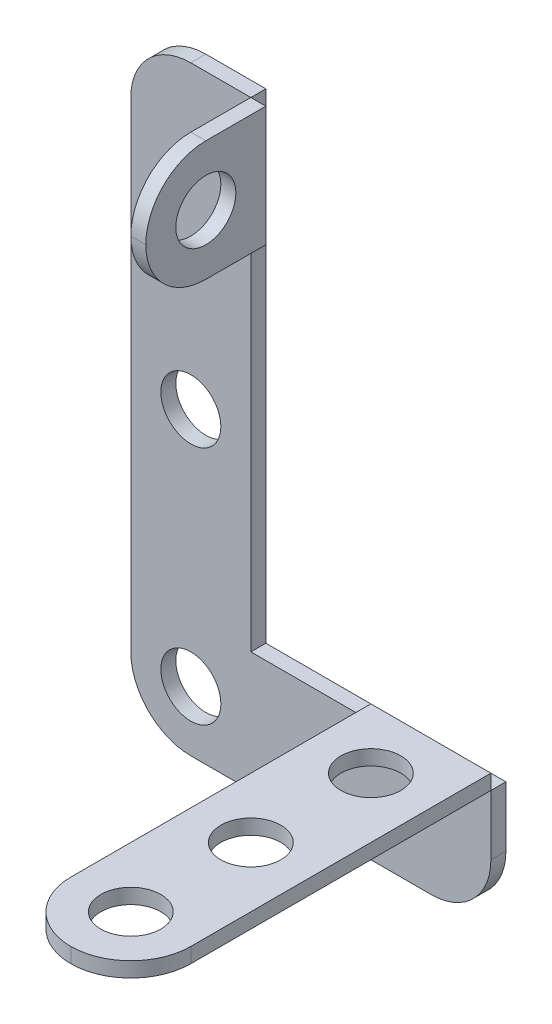
ISO-10303-21;
HEADER;
FILE_DESCRIPTION(('STEP AP214'),'2;1');
FILE_NAME('part.step','',(''),(''),'','','');
FILE_SCHEMA(('AUTOMOTIVE_DESIGN { 1 0 10303 214 1 1 1 1 }'));
ENDSEC;
DATA;
#1=APPLICATION_CONTEXT('core data for automotive mechanical design processes');
#2=APPLICATION_PROTOCOL_DEFINITION('international standard','automotive_design',2000,#1);
#3=PRODUCT_CONTEXT('',#1,'mechanical');
#4=PRODUCT('Part','Part','',(#3));
#5=PRODUCT_RELATED_PRODUCT_CATEGORY('part','',(#4));
#6=PRODUCT_DEFINITION_FORMATION('','',#4);
#7=PRODUCT_DEFINITION_CONTEXT('part definition',#1,'design');
#8=PRODUCT_DEFINITION('design','',#6,#7);
#9=PRODUCT_DEFINITION_SHAPE('','',#8);
#10=(LENGTH_UNIT() NAMED_UNIT(*) SI_UNIT(.MILLI.,.METRE.));
#11=(NAMED_UNIT(*) PLANE_ANGLE_UNIT() SI_UNIT($,.RADIAN.));
#12=(NAMED_UNIT(*) SI_UNIT($,.STERADIAN.) SOLID_ANGLE_UNIT());
#13=UNCERTAINTY_MEASURE_WITH_UNIT(LENGTH_MEASURE(1.E-05),#10,'distance_accuracy_value','');
#14=(GEOMETRIC_REPRESENTATION_CONTEXT(3) GLOBAL_UNCERTAINTY_ASSIGNED_CONTEXT((#13)) GLOBAL_UNIT_ASSIGNED_CONTEXT((#10,
#11,#12)) REPRESENTATION_CONTEXT('',''));
#15=CARTESIAN_POINT('',(0.,0.,0.));
#16=DIRECTION('',(0.,0.,1.));
#17=DIRECTION('',(1.,0.,0.));
#18=AXIS2_PLACEMENT_3D('',#15,#16,#17);
#19=CARTESIAN_POINT('',(0.,14.2875,0.));
#20=DIRECTION('',(0.,-1.,0.));
#21=DIRECTION('',(1.,0.,0.));
#22=AXIS2_PLACEMENT_3D('',#19,#20,#21);
#23=PLANE('',#22);
#24=DIRECTION('',(0.,0.,1.));
#25=VECTOR('',#24,1.);
#26=CARTESIAN_POINT('',(25.4,14.2875,1.5875));
#27=LINE('',#26,#25);
#28=CARTESIAN_POINT('',(25.4,14.2875,1.5875));
#29=VERTEX_POINT('',#28);
#30=CARTESIAN_POINT('',(25.4,14.2875,33.3375));
#31=VERTEX_POINT('',#30);
#32=EDGE_CURVE('E105',#29,#31,#27,.T.);
#33=ORIENTED_EDGE('',*,*,#32,.T.);
#34=CARTESIAN_POINT('',(31.75,14.2875,33.3375));
#35=DIRECTION('',(0.,-1.,0.));
#36=DIRECTION('',(1.,0.,0.));
#37=AXIS2_PLACEMENT_3D('',#34,#35,#36);
#38=CIRCLE('',#37,6.35);
#39=CARTESIAN_POINT('',(31.75,14.2875,39.6875));
#40=VERTEX_POINT('',#39);
#41=EDGE_CURVE('E56',#31,#40,#38,.F.);
#42=ORIENTED_EDGE('',*,*,#41,.T.);
#43=CARTESIAN_POINT('',(31.75,14.2875,33.3375));
#44=DIRECTION('',(0.,-1.,0.));
#45=DIRECTION('',(1.,0.,0.));
#46=AXIS2_PLACEMENT_3D('',#43,#44,#45);
#47=CIRCLE('',#46,6.35);
#48=CARTESIAN_POINT('',(38.1,14.2875,33.3375));
#49=VERTEX_POINT('',#48);
#50=EDGE_CURVE('E66',#40,#49,#47,.F.);
#51=ORIENTED_EDGE('',*,*,#50,.T.);
#52=DIRECTION('',(0.,0.,-1.));
#53=VECTOR('',#52,1.);
#54=CARTESIAN_POINT('',(38.1,14.2875,1.5875));
#55=LINE('',#54,#53);
#56=CARTESIAN_POINT('',(38.1,14.2875,1.5875));
#57=VERTEX_POINT('',#56);
#58=EDGE_CURVE('E88',#49,#57,#55,.T.);
#59=ORIENTED_EDGE('',*,*,#58,.T.);
#60=DIRECTION('',(-1.,0.,0.));
#61=VECTOR('',#60,1.);
#62=CARTESIAN_POINT('',(38.1,14.2875,1.5875));
#63=LINE('',#62,#61);
#64=EDGE_CURVE('E91',#57,#29,#63,.T.);
#65=ORIENTED_EDGE('',*,*,#64,.T.);
#66=EDGE_LOOP('',(#33,#42,#51,#59,#65));
#67=FACE_BOUND('',#66,.T.);
#68=CARTESIAN_POINT('',(31.75,14.2875,7.9375));
#69=DIRECTION('',(0.,1.,0.));
#70=DIRECTION('',(-1.,0.,0.));
#71=AXIS2_PLACEMENT_3D('',#68,#69,#70);
#72=CIRCLE('',#71,3.175);
#73=CARTESIAN_POINT('',(28.575,14.2875,7.9375));
#74=VERTEX_POINT('',#73);
#75=EDGE_CURVE('E134',#74,#74,#72,.T.);
#76=ORIENTED_EDGE('',*,*,#75,.F.);
#77=EDGE_LOOP('',(#76));
#78=FACE_BOUND('',#77,.T.);
#79=CARTESIAN_POINT('',(31.75,14.2875,20.6375));
#80=DIRECTION('',(0.,1.,0.));
#81=DIRECTION('',(-1.,0.,0.));
#82=AXIS2_PLACEMENT_3D('',#79,#80,#81);
#83=CIRCLE('',#82,3.175);
#84=CARTESIAN_POINT('',(28.575,14.2875,20.6375));
#85=VERTEX_POINT('',#84);
#86=EDGE_CURVE('E153',#85,#85,#83,.T.);
#87=ORIENTED_EDGE('',*,*,#86,.F.);
#88=EDGE_LOOP('',(#87));
#89=FACE_BOUND('',#88,.T.);
#90=CARTESIAN_POINT('',(31.75,14.2875,33.3375));
#91=DIRECTION('',(0.,1.,0.));
#92=DIRECTION('',(-1.,0.,0.));
#93=AXIS2_PLACEMENT_3D('',#90,#91,#92);
#94=CIRCLE('',#93,3.175);
#95=CARTESIAN_POINT('',(28.575,14.2875,33.3375));
#96=VERTEX_POINT('',#95);
#97=EDGE_CURVE('E145',#96,#96,#94,.T.);
#98=ORIENTED_EDGE('',*,*,#97,.F.);
#99=EDGE_LOOP('',(#98));
#100=FACE_BOUND('',#99,.T.);
#101=ADVANCED_FACE('F47',(#67,#78,#89,#100),#23,.F.);
#102=CARTESIAN_POINT('',(0.,12.7,0.));
#103=DIRECTION('',(0.,-1.,0.));
#104=DIRECTION('',(1.,0.,0.));
#105=AXIS2_PLACEMENT_3D('',#102,#103,#104);
#106=PLANE('',#105);
#107=CARTESIAN_POINT('',(31.75,12.7,20.6375));
#108=DIRECTION('',(0.,1.,0.));
#109=DIRECTION('',(-1.,0.,0.));
#110=AXIS2_PLACEMENT_3D('',#107,#108,#109);
#111=CIRCLE('',#110,3.175);
#112=CARTESIAN_POINT('',(28.575,12.7,20.6375));
#113=VERTEX_POINT('',#112);
#114=EDGE_CURVE('E150',#113,#113,#111,.T.);
#115=ORIENTED_EDGE('',*,*,#114,.T.);
#116=EDGE_LOOP('',(#115));
#117=FACE_BOUND('',#116,.T.);
#118=CARTESIAN_POINT('',(31.75,12.7,33.3375));
#119=DIRECTION('',(0.,-1.,0.));
#120=DIRECTION('',(1.,0.,0.));
#121=AXIS2_PLACEMENT_3D('',#118,#119,#120);
#122=CIRCLE('',#121,6.35);
#123=CARTESIAN_POINT('',(38.1,12.7,33.3375));
#124=VERTEX_POINT('',#123);
#125=CARTESIAN_POINT('',(31.75,12.7,39.6875));
#126=VERTEX_POINT('',#125);
#127=EDGE_CURVE('E111',#124,#126,#122,.T.);
#128=ORIENTED_EDGE('',*,*,#127,.T.);
#129=CARTESIAN_POINT('',(31.75,12.7,33.3375));
#130=DIRECTION('',(0.,-1.,0.));
#131=DIRECTION('',(1.,0.,0.));
#132=AXIS2_PLACEMENT_3D('',#129,#130,#131);
#133=CIRCLE('',#132,6.35);
#134=CARTESIAN_POINT('',(25.4,12.7,33.3375));
#135=VERTEX_POINT('',#134);
#136=EDGE_CURVE('E113',#126,#135,#133,.T.);
#137=ORIENTED_EDGE('',*,*,#136,.T.);
#138=DIRECTION('',(0.,0.,1.));
#139=VECTOR('',#138,1.);
#140=CARTESIAN_POINT('',(25.4,12.7,1.5875));
#141=LINE('',#140,#139);
#142=CARTESIAN_POINT('',(25.4,12.7,1.5875));
#143=VERTEX_POINT('',#142);
#144=EDGE_CURVE('E96',#143,#135,#141,.T.);
#145=ORIENTED_EDGE('',*,*,#144,.F.);
#146=DIRECTION('',(-1.,0.,0.));
#147=VECTOR('',#146,1.);
#148=CARTESIAN_POINT('',(38.1,12.7,1.5875));
#149=LINE('',#148,#147);
#150=CARTESIAN_POINT('',(38.1,12.7,1.5875));
#151=VERTEX_POINT('',#150);
#152=EDGE_CURVE('E133',#151,#143,#149,.T.);
#153=ORIENTED_EDGE('',*,*,#152,.F.);
#154=DIRECTION('',(0.,0.,-1.));
#155=VECTOR('',#154,1.);
#156=CARTESIAN_POINT('',(38.1,12.7,1.5875));
#157=LINE('',#156,#155);
#158=EDGE_CURVE('E109',#124,#151,#157,.T.);
#159=ORIENTED_EDGE('',*,*,#158,.F.);
#160=EDGE_LOOP('',(#128,#137,#145,#153,#159));
#161=FACE_BOUND('',#160,.T.);
#162=CARTESIAN_POINT('',(31.75,12.7,7.9375));
#163=DIRECTION('',(0.,1.,0.));
#164=DIRECTION('',(-1.,0.,0.));
#165=AXIS2_PLACEMENT_3D('',#162,#163,#164);
#166=CIRCLE('',#165,3.175);
#167=CARTESIAN_POINT('',(28.575,12.7,7.9375));
#168=VERTEX_POINT('',#167);
#169=EDGE_CURVE('E156',#168,#168,#166,.T.);
#170=ORIENTED_EDGE('',*,*,#169,.T.);
#171=EDGE_LOOP('',(#170));
#172=FACE_BOUND('',#171,.T.);
#173=CARTESIAN_POINT('',(31.75,12.7,33.3375));
#174=DIRECTION('',(0.,1.,0.));
#175=DIRECTION('',(-1.,0.,0.));
#176=AXIS2_PLACEMENT_3D('',#173,#174,#175);
#177=CIRCLE('',#176,3.175);
#178=CARTESIAN_POINT('',(28.575,12.7,33.3375));
#179=VERTEX_POINT('',#178);
#180=EDGE_CURVE('E143',#179,#179,#177,.T.);
#181=ORIENTED_EDGE('',*,*,#180,.T.);
#182=EDGE_LOOP('',(#181));
#183=FACE_BOUND('',#182,.T.);
#184=ADVANCED_FACE('F136',(#117,#161,#172,#183),#106,.T.);
#185=CARTESIAN_POINT('',(38.1,14.2875,1.5875));
#186=DIRECTION('',(-1.,0.,0.));
#187=DIRECTION('',(0.,-1.,0.));
#188=AXIS2_PLACEMENT_3D('',#185,#186,#187);
#189=PLANE('',#188);
#190=ORIENTED_EDGE('',*,*,#58,.F.);
#191=DIRECTION('',(0.,-1.,0.));
#192=VECTOR('',#191,1.);
#193=CARTESIAN_POINT('',(38.1,14.2875,33.3375));
#194=LINE('',#193,#192);
#195=EDGE_CURVE('E12',#49,#124,#194,.T.);
#196=ORIENTED_EDGE('',*,*,#195,.T.);
#197=ORIENTED_EDGE('',*,*,#158,.T.);
#198=DIRECTION('',(0.,-1.,0.));
#199=VECTOR('',#198,1.);
#200=CARTESIAN_POINT('',(38.1,14.2875,1.5875));
#201=LINE('',#200,#199);
#202=EDGE_CURVE('E101',#57,#151,#201,.T.);
#203=ORIENTED_EDGE('',*,*,#202,.F.);
#204=EDGE_LOOP('',(#190,#196,#197,#203));
#205=FACE_BOUND('',#204,.T.);
#206=ADVANCED_FACE('F107',(#205),#189,.F.);
#207=CARTESIAN_POINT('',(38.1,14.2875,1.5875));
#208=DIRECTION('',(0.,0.,1.));
#209=DIRECTION('',(1.,0.,0.));
#210=AXIS2_PLACEMENT_3D('',#207,#208,#209);
#211=PLANE('',#210);
#212=ORIENTED_EDGE('',*,*,#152,.T.);
#213=DIRECTION('',(0.,-1.,0.));
#214=VECTOR('',#213,1.);
#215=CARTESIAN_POINT('',(25.4,14.2875,1.5875));
#216=LINE('',#215,#214);
#217=EDGE_CURVE('E103',#29,#143,#216,.T.);
#218=ORIENTED_EDGE('',*,*,#217,.F.);
#219=ORIENTED_EDGE('',*,*,#64,.F.);
#220=ORIENTED_EDGE('',*,*,#202,.T.);
#221=EDGE_LOOP('',(#212,#218,#219,#220));
#222=FACE_BOUND('',#221,.T.);
#223=ADVANCED_FACE('F100',(#222),#211,.F.);
#224=CARTESIAN_POINT('',(25.4,14.2875,1.5875));
#225=DIRECTION('',(1.,0.,0.));
#226=DIRECTION('',(0.,1.,0.));
#227=AXIS2_PLACEMENT_3D('',#224,#225,#226);
#228=PLANE('',#227);
#229=ORIENTED_EDGE('',*,*,#144,.T.);
#230=DIRECTION('',(0.,-1.,0.));
#231=VECTOR('',#230,1.);
#232=CARTESIAN_POINT('',(25.4,14.2875,33.3375));
#233=LINE('',#232,#231);
#234=EDGE_CURVE('E119',#135,#31,#233,.F.);
#235=ORIENTED_EDGE('',*,*,#234,.T.);
#236=ORIENTED_EDGE('',*,*,#32,.F.);
#237=ORIENTED_EDGE('',*,*,#217,.T.);
#238=EDGE_LOOP('',(#229,#235,#236,#237));
#239=FACE_BOUND('',#238,.T.);
#240=ADVANCED_FACE('F126',(#239),#228,.F.);
#241=CARTESIAN_POINT('',(31.75,14.2875,7.9375));
#242=DIRECTION('',(0.,-1.,0.));
#243=DIRECTION('',(1.,0.,0.));
#244=AXIS2_PLACEMENT_3D('',#241,#242,#243);
#245=CYLINDRICAL_SURFACE('',#244,3.175);
#246=ORIENTED_EDGE('',*,*,#75,.T.);
#247=EDGE_LOOP('',(#246));
#248=FACE_BOUND('',#247,.T.);
#249=ORIENTED_EDGE('',*,*,#169,.F.);
#250=EDGE_LOOP('',(#249));
#251=FACE_BOUND('',#250,.T.);
#252=ADVANCED_FACE('F164',(#248,#251),#245,.F.);
#253=CARTESIAN_POINT('',(31.75,14.2875,20.6375));
#254=DIRECTION('',(0.,-1.,0.));
#255=DIRECTION('',(1.,0.,0.));
#256=AXIS2_PLACEMENT_3D('',#253,#254,#255);
#257=CYLINDRICAL_SURFACE('',#256,3.175);
#258=ORIENTED_EDGE('',*,*,#86,.T.);
#259=EDGE_LOOP('',(#258));
#260=FACE_BOUND('',#259,.T.);
#261=ORIENTED_EDGE('',*,*,#114,.F.);
#262=EDGE_LOOP('',(#261));
#263=FACE_BOUND('',#262,.T.);
#264=ADVANCED_FACE('F166',(#260,#263),#257,.F.);
#265=CARTESIAN_POINT('',(31.75,14.2875,33.3375));
#266=DIRECTION('',(0.,-1.,0.));
#267=DIRECTION('',(1.,0.,0.));
#268=AXIS2_PLACEMENT_3D('',#265,#266,#267);
#269=CYLINDRICAL_SURFACE('',#268,3.175);
#270=ORIENTED_EDGE('',*,*,#97,.T.);
#271=EDGE_LOOP('',(#270));
#272=FACE_BOUND('',#271,.T.);
#273=ORIENTED_EDGE('',*,*,#180,.F.);
#274=EDGE_LOOP('',(#273));
#275=FACE_BOUND('',#274,.T.);
#276=ADVANCED_FACE('F173',(#272,#275),#269,.F.);
#277=CARTESIAN_POINT('',(31.75,14.2875,33.3375));
#278=DIRECTION('',(0.,-1.,0.));
#279=DIRECTION('',(1.,0.,0.));
#280=AXIS2_PLACEMENT_3D('',#277,#278,#279);
#281=CYLINDRICAL_SURFACE('',#280,6.35);
#282=ORIENTED_EDGE('',*,*,#195,.F.);
#283=ORIENTED_EDGE('',*,*,#50,.F.);
#284=DIRECTION('',(0.,-1.,0.));
#285=VECTOR('',#284,1.);
#286=CARTESIAN_POINT('',(31.75,14.2875,39.6875));
#287=LINE('',#286,#285);
#288=EDGE_CURVE('E51',#126,#40,#287,.F.);
#289=ORIENTED_EDGE('',*,*,#288,.F.);
#290=ORIENTED_EDGE('',*,*,#127,.F.);
#291=EDGE_LOOP('',(#282,#283,#289,#290));
#292=FACE_BOUND('',#291,.T.);
#293=ADVANCED_FACE('F49',(#292),#281,.T.);
#294=CARTESIAN_POINT('',(31.75,14.2875,33.3375));
#295=DIRECTION('',(0.,-1.,0.));
#296=DIRECTION('',(1.,0.,0.));
#297=AXIS2_PLACEMENT_3D('',#294,#295,#296);
#298=CYLINDRICAL_SURFACE('',#297,6.35);
#299=ORIENTED_EDGE('',*,*,#41,.F.);
#300=ORIENTED_EDGE('',*,*,#234,.F.);
#301=ORIENTED_EDGE('',*,*,#136,.F.);
#302=ORIENTED_EDGE('',*,*,#288,.T.);
#303=EDGE_LOOP('',(#299,#300,#301,#302));
#304=FACE_BOUND('',#303,.T.);
#305=ADVANCED_FACE('F141',(#304),#298,.T.);
#306=CLOSED_SHELL('',(#101,#184,#206,#223,#240,#252,#264,#276,#293,#305));
#307=MANIFOLD_SOLID_BREP('B2',#306);
#308=CARTESIAN_POINT('',(14.2875,0.,0.));
#309=DIRECTION('',(-1.,0.,0.));
#310=DIRECTION('',(0.,-1.,0.));
#311=AXIS2_PLACEMENT_3D('',#308,#309,#310);
#312=PLANE('',#311);
#313=CARTESIAN_POINT('',(14.2875,57.15,7.93749999999999));
#314=DIRECTION('',(-1.,0.,0.));
#315=DIRECTION('',(0.,-1.,0.));
#316=AXIS2_PLACEMENT_3D('',#313,#314,#315);
#317=CIRCLE('',#316,6.35);
#318=CARTESIAN_POINT('',(14.2875,63.5,7.93749999999999));
#319=VERTEX_POINT('',#318);
#320=CARTESIAN_POINT('',(14.2875,57.15,14.2875));
#321=VERTEX_POINT('',#320);
#322=EDGE_CURVE('E284',#319,#321,#317,.F.);
#323=ORIENTED_EDGE('',*,*,#322,.T.);
#324=CARTESIAN_POINT('',(14.2875,57.15,7.93749999999999));
#325=DIRECTION('',(-1.,0.,0.));
#326=DIRECTION('',(0.,-1.,0.));
#327=AXIS2_PLACEMENT_3D('',#324,#325,#326);
#328=CIRCLE('',#327,6.35);
#329=CARTESIAN_POINT('',(14.2875,50.8,7.93749999999999));
#330=VERTEX_POINT('',#329);
#331=EDGE_CURVE('E277',#321,#330,#328,.F.);
#332=ORIENTED_EDGE('',*,*,#331,.T.);
#333=DIRECTION('',(0.,0.,-1.));
#334=VECTOR('',#333,1.);
#335=CARTESIAN_POINT('',(14.2875,50.8,1.5875));
#336=LINE('',#335,#334);
#337=CARTESIAN_POINT('',(14.2875,50.8,1.5875));
#338=VERTEX_POINT('',#337);
#339=EDGE_CURVE('E319',#330,#338,#336,.T.);
#340=ORIENTED_EDGE('',*,*,#339,.T.);
#341=DIRECTION('',(0.,1.,0.));
#342=VECTOR('',#341,1.);
#343=CARTESIAN_POINT('',(14.2875,63.5,1.5875));
#344=LINE('',#343,#342);
#345=CARTESIAN_POINT('',(14.2875,63.5,1.5875));
#346=VERTEX_POINT('',#345);
#347=EDGE_CURVE('E320',#338,#346,#344,.T.);
#348=ORIENTED_EDGE('',*,*,#347,.T.);
#349=DIRECTION('',(0.,0.,1.));
#350=VECTOR('',#349,1.);
#351=CARTESIAN_POINT('',(14.2875,63.5,1.5875));
#352=LINE('',#351,#350);
#353=EDGE_CURVE('E313',#346,#319,#352,.T.);
#354=ORIENTED_EDGE('',*,*,#353,.T.);
#355=EDGE_LOOP('',(#323,#332,#340,#348,#354));
#356=FACE_BOUND('',#355,.T.);
#357=CARTESIAN_POINT('',(14.2875,57.15,7.93749999999999));
#358=DIRECTION('',(1.,0.,0.));
#359=DIRECTION('',(0.,1.,0.));
#360=AXIS2_PLACEMENT_3D('',#357,#358,#359);
#361=CIRCLE('',#360,3.175);
#362=CARTESIAN_POINT('',(14.2875,60.325,7.93749999999999));
#363=VERTEX_POINT('',#362);
#364=EDGE_CURVE('E362',#363,#363,#361,.T.);
#365=ORIENTED_EDGE('',*,*,#364,.F.);
#366=EDGE_LOOP('',(#365));
#367=FACE_BOUND('',#366,.T.);
#368=ADVANCED_FACE('F268',(#356,#367),#312,.F.);
#369=CARTESIAN_POINT('',(12.7,0.,0.));
#370=DIRECTION('',(-1.,0.,0.));
#371=DIRECTION('',(0.,-1.,0.));
#372=AXIS2_PLACEMENT_3D('',#369,#370,#371);
#373=PLANE('',#372);
#374=DIRECTION('',(0.,0.,-1.));
#375=VECTOR('',#374,1.);
#376=CARTESIAN_POINT('',(12.7,50.8,1.5875));
#377=LINE('',#376,#375);
#378=CARTESIAN_POINT('',(12.7,50.8,7.93749999999999));
#379=VERTEX_POINT('',#378);
#380=CARTESIAN_POINT('',(12.7,50.8,1.5875));
#381=VERTEX_POINT('',#380);
#382=EDGE_CURVE('E328',#379,#381,#377,.T.);
#383=ORIENTED_EDGE('',*,*,#382,.F.);
#384=CARTESIAN_POINT('',(12.7,57.15,7.93749999999999));
#385=DIRECTION('',(-1.,0.,0.));
#386=DIRECTION('',(0.,-1.,0.));
#387=AXIS2_PLACEMENT_3D('',#384,#385,#386);
#388=CIRCLE('',#387,6.35);
#389=CARTESIAN_POINT('',(12.7,57.15,14.2875));
#390=VERTEX_POINT('',#389);
#391=EDGE_CURVE('E343',#379,#390,#388,.T.);
#392=ORIENTED_EDGE('',*,*,#391,.T.);
#393=CARTESIAN_POINT('',(12.7,57.15,7.93749999999999));
#394=DIRECTION('',(-1.,0.,0.));
#395=DIRECTION('',(0.,-1.,0.));
#396=AXIS2_PLACEMENT_3D('',#393,#394,#395);
#397=CIRCLE('',#396,6.35);
#398=CARTESIAN_POINT('',(12.7,63.5,7.93749999999999));
#399=VERTEX_POINT('',#398);
#400=EDGE_CURVE('E337',#390,#399,#397,.T.);
#401=ORIENTED_EDGE('',*,*,#400,.T.);
#402=DIRECTION('',(0.,0.,1.));
#403=VECTOR('',#402,1.);
#404=CARTESIAN_POINT('',(12.7,63.5,1.5875));
#405=LINE('',#404,#403);
#406=CARTESIAN_POINT('',(12.7,63.5,1.5875));
#407=VERTEX_POINT('',#406);
#408=EDGE_CURVE('E369',#407,#399,#405,.T.);
#409=ORIENTED_EDGE('',*,*,#408,.F.);
#410=DIRECTION('',(0.,1.,0.));
#411=VECTOR('',#410,1.);
#412=CARTESIAN_POINT('',(12.7,63.5,1.5875));
#413=LINE('',#412,#411);
#414=EDGE_CURVE('E332',#381,#407,#413,.T.);
#415=ORIENTED_EDGE('',*,*,#414,.F.);
#416=EDGE_LOOP('',(#383,#392,#401,#409,#415));
#417=FACE_BOUND('',#416,.T.);
#418=CARTESIAN_POINT('',(12.7,57.15,7.93749999999999));
#419=DIRECTION('',(1.,0.,0.));
#420=DIRECTION('',(0.,1.,0.));
#421=AXIS2_PLACEMENT_3D('',#418,#419,#420);
#422=CIRCLE('',#421,3.175);
#423=CARTESIAN_POINT('',(12.7,60.325,7.93749999999999));
#424=VERTEX_POINT('',#423);
#425=EDGE_CURVE('E360',#424,#424,#422,.T.);
#426=ORIENTED_EDGE('',*,*,#425,.T.);
#427=EDGE_LOOP('',(#426));
#428=FACE_BOUND('',#427,.T.);
#429=ADVANCED_FACE('F357',(#417,#428),#373,.T.);
#430=CARTESIAN_POINT('',(14.2875,63.5,1.5875));
#431=DIRECTION('',(0.,0.,1.));
#432=DIRECTION('',(0.,-1.,0.));
#433=AXIS2_PLACEMENT_3D('',#430,#431,#432);
#434=PLANE('',#433);
#435=ORIENTED_EDGE('',*,*,#414,.T.);
#436=DIRECTION('',(-1.,0.,0.));
#437=VECTOR('',#436,1.);
#438=CARTESIAN_POINT('',(14.2875,63.5,1.5875));
#439=LINE('',#438,#437);
#440=EDGE_CURVE('E317',#346,#407,#439,.T.);
#441=ORIENTED_EDGE('',*,*,#440,.F.);
#442=ORIENTED_EDGE('',*,*,#347,.F.);
#443=DIRECTION('',(-1.,0.,0.));
#444=VECTOR('',#443,1.);
#445=CARTESIAN_POINT('',(14.2875,50.8,1.5875));
#446=LINE('',#445,#444);
#447=EDGE_CURVE('E334',#338,#381,#446,.T.);
#448=ORIENTED_EDGE('',*,*,#447,.T.);
#449=EDGE_LOOP('',(#435,#441,#442,#448));
#450=FACE_BOUND('',#449,.T.);
#451=ADVANCED_FACE('F330',(#450),#434,.F.);
#452=CARTESIAN_POINT('',(14.2875,63.5,1.5875));
#453=DIRECTION('',(0.,-1.,0.));
#454=DIRECTION('',(1.,0.,0.));
#455=AXIS2_PLACEMENT_3D('',#452,#453,#454);
#456=PLANE('',#455);
#457=ORIENTED_EDGE('',*,*,#408,.T.);
#458=DIRECTION('',(-1.,0.,0.));
#459=VECTOR('',#458,1.);
#460=CARTESIAN_POINT('',(14.2875,63.5,7.93749999999999));
#461=LINE('',#460,#459);
#462=EDGE_CURVE('E45',#399,#319,#461,.F.);
#463=ORIENTED_EDGE('',*,*,#462,.T.);
#464=ORIENTED_EDGE('',*,*,#353,.F.);
#465=ORIENTED_EDGE('',*,*,#440,.T.);
#466=EDGE_LOOP('',(#457,#463,#464,#465));
#467=FACE_BOUND('',#466,.T.);
#468=ADVANCED_FACE('F315',(#467),#456,.F.);
#469=CARTESIAN_POINT('',(14.2875,50.8,1.5875));
#470=DIRECTION('',(0.,1.,0.));
#471=DIRECTION('',(-1.,0.,0.));
#472=AXIS2_PLACEMENT_3D('',#469,#470,#471);
#473=PLANE('',#472);
#474=ORIENTED_EDGE('',*,*,#339,.F.);
#475=DIRECTION('',(-1.,0.,0.));
#476=VECTOR('',#475,1.);
#477=CARTESIAN_POINT('',(14.2875,50.8,7.93749999999999));
#478=LINE('',#477,#476);
#479=EDGE_CURVE('E333',#330,#379,#478,.T.);
#480=ORIENTED_EDGE('',*,*,#479,.T.);
#481=ORIENTED_EDGE('',*,*,#382,.T.);
#482=ORIENTED_EDGE('',*,*,#447,.F.);
#483=EDGE_LOOP('',(#474,#480,#481,#482));
#484=FACE_BOUND('',#483,.T.);
#485=ADVANCED_FACE('F351',(#484),#473,.F.);
#486=CARTESIAN_POINT('',(14.2875,57.15,7.93749999999999));
#487=DIRECTION('',(-1.,0.,0.));
#488=DIRECTION('',(0.,-1.,0.));
#489=AXIS2_PLACEMENT_3D('',#486,#487,#488);
#490=CYLINDRICAL_SURFACE('',#489,3.175);
#491=ORIENTED_EDGE('',*,*,#364,.T.);
#492=EDGE_LOOP('',(#491));
#493=FACE_BOUND('',#492,.T.);
#494=ORIENTED_EDGE('',*,*,#425,.F.);
#495=EDGE_LOOP('',(#494));
#496=FACE_BOUND('',#495,.T.);
#497=ADVANCED_FACE('F372',(#493,#496),#490,.F.);
#498=CARTESIAN_POINT('',(14.2875,57.15,7.93749999999999));
#499=DIRECTION('',(-1.,0.,0.));
#500=DIRECTION('',(0.,-1.,0.));
#501=AXIS2_PLACEMENT_3D('',#498,#499,#500);
#502=CYLINDRICAL_SURFACE('',#501,6.35);
#503=DIRECTION('',(-1.,0.,0.));
#504=VECTOR('',#503,1.);
#505=CARTESIAN_POINT('',(14.2875,57.15,14.2875));
#506=LINE('',#505,#504);
#507=EDGE_CURVE('E272',#321,#390,#506,.T.);
#508=ORIENTED_EDGE('',*,*,#507,.F.);
#509=ORIENTED_EDGE('',*,*,#322,.F.);
#510=ORIENTED_EDGE('',*,*,#462,.F.);
#511=ORIENTED_EDGE('',*,*,#400,.F.);
#512=EDGE_LOOP('',(#508,#509,#510,#511));
#513=FACE_BOUND('',#512,.T.);
#514=ADVANCED_FACE('F270',(#513),#502,.T.);
#515=CARTESIAN_POINT('',(14.2875,57.15,7.93749999999999));
#516=DIRECTION('',(-1.,0.,0.));
#517=DIRECTION('',(0.,-1.,0.));
#518=AXIS2_PLACEMENT_3D('',#515,#516,#517);
#519=CYLINDRICAL_SURFACE('',#518,6.35);
#520=ORIENTED_EDGE('',*,*,#331,.F.);
#521=ORIENTED_EDGE('',*,*,#507,.T.);
#522=ORIENTED_EDGE('',*,*,#391,.F.);
#523=ORIENTED_EDGE('',*,*,#479,.F.);
#524=EDGE_LOOP('',(#520,#521,#522,#523));
#525=FACE_BOUND('',#524,.T.);
#526=ADVANCED_FACE('F354',(#525),#519,.T.);
#527=CLOSED_SHELL('',(#368,#429,#451,#468,#485,#497,#514,#526));
#528=MANIFOLD_SOLID_BREP('B6',#527);
#529=CARTESIAN_POINT('',(0.,0.,1.5875));
#530=DIRECTION('',(0.,0.,-1.));
#531=DIRECTION('',(-1.,0.,0.));
#532=AXIS2_PLACEMENT_3D('',#529,#530,#531);
#533=PLANE('',#532);
#534=DIRECTION('',(-1.,0.,0.));
#535=VECTOR('',#534,1.);
#536=CARTESIAN_POINT('',(12.7,63.5,1.5875));
#537=LINE('',#536,#535);
#538=CARTESIAN_POINT('',(12.7,63.5,1.5875));
#539=VERTEX_POINT('',#538);
#540=CARTESIAN_POINT('',(6.35,63.5,1.5875));
#541=VERTEX_POINT('',#540);
#542=EDGE_CURVE('E534',#539,#541,#537,.T.);
#543=ORIENTED_EDGE('',*,*,#542,.T.);
#544=CARTESIAN_POINT('',(6.35,57.15,1.5875));
#545=DIRECTION('',(0.,0.,-1.));
#546=DIRECTION('',(-1.,0.,0.));
#547=AXIS2_PLACEMENT_3D('',#544,#545,#546);
#548=CIRCLE('',#547,6.35);
#549=CARTESIAN_POINT('',(0.,57.15,1.5875));
#550=VERTEX_POINT('',#549);
#551=EDGE_CURVE('E575',#541,#550,#548,.F.);
#552=ORIENTED_EDGE('',*,*,#551,.T.);
#553=DIRECTION('',(0.,-1.,0.));
#554=VECTOR('',#553,1.);
#555=CARTESIAN_POINT('',(0.,0.,1.5875));
#556=LINE('',#555,#554);
#557=CARTESIAN_POINT('',(0.,6.35,1.5875));
#558=VERTEX_POINT('',#557);
#559=EDGE_CURVE('E539',#550,#558,#556,.T.);
#560=ORIENTED_EDGE('',*,*,#559,.T.);
#561=CARTESIAN_POINT('',(6.35,6.35,1.5875));
#562=DIRECTION('',(0.,0.,-1.));
#563=DIRECTION('',(-1.,0.,0.));
#564=AXIS2_PLACEMENT_3D('',#561,#562,#563);
#565=CIRCLE('',#564,6.35);
#566=CARTESIAN_POINT('',(6.35,0.,1.5875));
#567=VERTEX_POINT('',#566);
#568=EDGE_CURVE('E573',#558,#567,#565,.F.);
#569=ORIENTED_EDGE('',*,*,#568,.T.);
#570=DIRECTION('',(1.,0.,0.));
#571=VECTOR('',#570,1.);
#572=CARTESIAN_POINT('',(12.7,0.,1.5875));
#573=LINE('',#572,#571);
#574=CARTESIAN_POINT('',(31.75,0.,1.5875));
#575=VERTEX_POINT('',#574);
#576=EDGE_CURVE('E517',#567,#575,#573,.T.);
#577=ORIENTED_EDGE('',*,*,#576,.T.);
#578=CARTESIAN_POINT('',(31.75,6.35,1.5875));
#579=DIRECTION('',(0.,0.,-1.));
#580=DIRECTION('',(-1.,0.,0.));
#581=AXIS2_PLACEMENT_3D('',#578,#579,#580);
#582=CIRCLE('',#581,6.35);
#583=CARTESIAN_POINT('',(38.1,6.35,1.5875));
#584=VERTEX_POINT('',#583);
#585=EDGE_CURVE('E453',#575,#584,#582,.F.);
#586=ORIENTED_EDGE('',*,*,#585,.T.);
#587=DIRECTION('',(0.,1.,0.));
#588=VECTOR('',#587,1.);
#589=CARTESIAN_POINT('',(38.1,0.,1.5875));
#590=LINE('',#589,#588);
#591=CARTESIAN_POINT('',(38.1,12.7,1.5875));
#592=VERTEX_POINT('',#591);
#593=EDGE_CURVE('E508',#584,#592,#590,.T.);
#594=ORIENTED_EDGE('',*,*,#593,.T.);
#595=DIRECTION('',(-1.,0.,0.));
#596=VECTOR('',#595,1.);
#597=CARTESIAN_POINT('',(38.1,12.7,1.5875));
#598=LINE('',#597,#596);
#599=CARTESIAN_POINT('',(12.7,12.7,1.5875));
#600=VERTEX_POINT('',#599);
#601=EDGE_CURVE('E513',#592,#600,#598,.T.);
#602=ORIENTED_EDGE('',*,*,#601,.T.);
#603=DIRECTION('',(0.,1.,0.));
#604=VECTOR('',#603,1.);
#605=CARTESIAN_POINT('',(12.7,63.5,1.5875));
#606=LINE('',#605,#604);
#607=EDGE_CURVE('E532',#600,#539,#606,.T.);
#608=ORIENTED_EDGE('',*,*,#607,.T.);
#609=EDGE_LOOP('',(#543,#552,#560,#569,#577,#586,#594,#602,#608));
#610=FACE_BOUND('',#609,.T.);
#611=CARTESIAN_POINT('',(6.35000000000001,31.75,1.5875));
#612=DIRECTION('',(0.,0.,1.));
#613=DIRECTION('',(1.,0.,0.));
#614=AXIS2_PLACEMENT_3D('',#611,#612,#613);
#615=CIRCLE('',#614,3.175);
#616=CARTESIAN_POINT('',(9.52500000000001,31.75,1.5875));
#617=VERTEX_POINT('',#616);
#618=EDGE_CURVE('E545',#617,#617,#615,.T.);
#619=ORIENTED_EDGE('',*,*,#618,.F.);
#620=EDGE_LOOP('',(#619));
#621=FACE_BOUND('',#620,.T.);
#622=CARTESIAN_POINT('',(6.35000000000001,6.35,1.5875));
#623=DIRECTION('',(0.,0.,1.));
#624=DIRECTION('',(1.,0.,0.));
#625=AXIS2_PLACEMENT_3D('',#622,#623,#624);
#626=CIRCLE('',#625,3.175);
#627=CARTESIAN_POINT('',(9.52500000000001,6.35,1.5875));
#628=VERTEX_POINT('',#627);
#629=EDGE_CURVE('E641',#628,#628,#626,.T.);
#630=ORIENTED_EDGE('',*,*,#629,.F.);
#631=EDGE_LOOP('',(#630));
#632=FACE_BOUND('',#631,.T.);
#633=ADVANCED_FACE('F438',(#610,#621,#632),#533,.F.);
#634=CARTESIAN_POINT('',(0.,0.,0.));
#635=DIRECTION('',(0.,0.,-1.));
#636=DIRECTION('',(-1.,0.,0.));
#637=AXIS2_PLACEMENT_3D('',#634,#635,#636);
#638=PLANE('',#637);
#639=CARTESIAN_POINT('',(6.35000000000001,31.75,0.));
#640=DIRECTION('',(0.,0.,1.));
#641=DIRECTION('',(1.,0.,0.));
#642=AXIS2_PLACEMENT_3D('',#639,#640,#641);
#643=CIRCLE('',#642,3.175);
#644=CARTESIAN_POINT('',(9.52500000000001,31.75,0.));
#645=VERTEX_POINT('',#644);
#646=EDGE_CURVE('E638',#645,#645,#643,.T.);
#647=ORIENTED_EDGE('',*,*,#646,.T.);
#648=EDGE_LOOP('',(#647));
#649=FACE_BOUND('',#648,.T.);
#650=DIRECTION('',(0.,-1.,0.));
#651=VECTOR('',#650,1.);
#652=CARTESIAN_POINT('',(0.,0.,0.));
#653=LINE('',#652,#651);
#654=CARTESIAN_POINT('',(0.,57.15,0.));
#655=VERTEX_POINT('',#654);
#656=CARTESIAN_POINT('',(0.,6.35,0.));
#657=VERTEX_POINT('',#656);
#658=EDGE_CURVE('E554',#655,#657,#653,.T.);
#659=ORIENTED_EDGE('',*,*,#658,.F.);
#660=CARTESIAN_POINT('',(6.35,57.15,0.));
#661=DIRECTION('',(0.,0.,-1.));
#662=DIRECTION('',(-1.,0.,0.));
#663=AXIS2_PLACEMENT_3D('',#660,#661,#662);
#664=CIRCLE('',#663,6.35);
#665=CARTESIAN_POINT('',(6.35,63.5,0.));
#666=VERTEX_POINT('',#665);
#667=EDGE_CURVE('E568',#655,#666,#664,.T.);
#668=ORIENTED_EDGE('',*,*,#667,.T.);
#669=DIRECTION('',(-1.,0.,0.));
#670=VECTOR('',#669,1.);
#671=CARTESIAN_POINT('',(12.7,63.5,0.));
#672=LINE('',#671,#670);
#673=CARTESIAN_POINT('',(12.7,63.5,0.));
#674=VERTEX_POINT('',#673);
#675=EDGE_CURVE('E551',#674,#666,#672,.T.);
#676=ORIENTED_EDGE('',*,*,#675,.F.);
#677=DIRECTION('',(0.,1.,0.));
#678=VECTOR('',#677,1.);
#679=CARTESIAN_POINT('',(12.7,63.5,0.));
#680=LINE('',#679,#678);
#681=CARTESIAN_POINT('',(12.7,12.7,0.));
#682=VERTEX_POINT('',#681);
#683=EDGE_CURVE('E549',#682,#674,#680,.T.);
#684=ORIENTED_EDGE('',*,*,#683,.F.);
#685=DIRECTION('',(-1.,0.,0.));
#686=VECTOR('',#685,1.);
#687=CARTESIAN_POINT('',(38.1,12.7,0.));
#688=LINE('',#687,#686);
#689=CARTESIAN_POINT('',(38.1,12.7,0.));
#690=VERTEX_POINT('',#689);
#691=EDGE_CURVE('E547',#690,#682,#688,.T.);
#692=ORIENTED_EDGE('',*,*,#691,.F.);
#693=DIRECTION('',(0.,1.,0.));
#694=VECTOR('',#693,1.);
#695=CARTESIAN_POINT('',(38.1,0.,0.));
#696=LINE('',#695,#694);
#697=CARTESIAN_POINT('',(38.1,6.35,0.));
#698=VERTEX_POINT('',#697);
#699=EDGE_CURVE('E523',#698,#690,#696,.T.);
#700=ORIENTED_EDGE('',*,*,#699,.F.);
#701=CARTESIAN_POINT('',(31.75,6.35,0.));
#702=DIRECTION('',(0.,0.,-1.));
#703=DIRECTION('',(-1.,0.,0.));
#704=AXIS2_PLACEMENT_3D('',#701,#702,#703);
#705=CIRCLE('',#704,6.35);
#706=CARTESIAN_POINT('',(31.75,0.,0.));
#707=VERTEX_POINT('',#706);
#708=EDGE_CURVE('E564',#698,#707,#705,.T.);
#709=ORIENTED_EDGE('',*,*,#708,.T.);
#710=DIRECTION('',(1.,0.,0.));
#711=VECTOR('',#710,1.);
#712=CARTESIAN_POINT('',(12.7,0.,0.));
#713=LINE('',#712,#711);
#714=CARTESIAN_POINT('',(6.35,0.,0.));
#715=VERTEX_POINT('',#714);
#716=EDGE_CURVE('E543',#715,#707,#713,.T.);
#717=ORIENTED_EDGE('',*,*,#716,.F.);
#718=CARTESIAN_POINT('',(6.35,6.35,0.));
#719=DIRECTION('',(0.,0.,-1.));
#720=DIRECTION('',(-1.,0.,0.));
#721=AXIS2_PLACEMENT_3D('',#718,#719,#720);
#722=CIRCLE('',#721,6.35);
#723=EDGE_CURVE('E566',#715,#657,#722,.T.);
#724=ORIENTED_EDGE('',*,*,#723,.T.);
#725=EDGE_LOOP('',(#659,#668,#676,#684,#692,#700,#709,#717,#724));
#726=FACE_BOUND('',#725,.T.);
#727=CARTESIAN_POINT('',(6.35000000000001,6.35,0.));
#728=DIRECTION('',(0.,0.,1.));
#729=DIRECTION('',(1.,0.,0.));
#730=AXIS2_PLACEMENT_3D('',#727,#728,#729);
#731=CIRCLE('',#730,3.175);
#732=CARTESIAN_POINT('',(9.52500000000001,6.35,0.));
#733=VERTEX_POINT('',#732);
#734=EDGE_CURVE('E644',#733,#733,#731,.T.);
#735=ORIENTED_EDGE('',*,*,#734,.T.);
#736=EDGE_LOOP('',(#735));
#737=FACE_BOUND('',#736,.T.);
#738=ADVANCED_FACE('F585',(#649,#726,#737),#638,.T.);
#739=CARTESIAN_POINT('',(12.7,0.,1.5875));
#740=DIRECTION('',(0.,1.,0.));
#741=DIRECTION('',(-1.,0.,0.));
#742=AXIS2_PLACEMENT_3D('',#739,#740,#741);
#743=PLANE('',#742);
#744=ORIENTED_EDGE('',*,*,#576,.F.);
#745=DIRECTION('',(0.,0.,-1.));
#746=VECTOR('',#745,1.);
#747=CARTESIAN_POINT('',(6.35,0.,1.5875));
#748=LINE('',#747,#746);
#749=EDGE_CURVE('E446',#567,#715,#748,.T.);
#750=ORIENTED_EDGE('',*,*,#749,.T.);
#751=ORIENTED_EDGE('',*,*,#716,.T.);
#752=DIRECTION('',(0.,0.,-1.));
#753=VECTOR('',#752,1.);
#754=CARTESIAN_POINT('',(31.75,0.,1.5875));
#755=LINE('',#754,#753);
#756=EDGE_CURVE('E461',#707,#575,#755,.F.);
#757=ORIENTED_EDGE('',*,*,#756,.T.);
#758=EDGE_LOOP('',(#744,#750,#751,#757));
#759=FACE_BOUND('',#758,.T.);
#760=ADVANCED_FACE('F580',(#759),#743,.F.);
#761=CARTESIAN_POINT('',(38.1,0.,1.5875));
#762=DIRECTION('',(-1.,0.,0.));
#763=DIRECTION('',(0.,0.,1.));
#764=AXIS2_PLACEMENT_3D('',#761,#762,#763);
#765=PLANE('',#764);
#766=ORIENTED_EDGE('',*,*,#593,.F.);
#767=DIRECTION('',(0.,0.,-1.));
#768=VECTOR('',#767,1.);
#769=CARTESIAN_POINT('',(38.1,6.35,1.5875));
#770=LINE('',#769,#768);
#771=EDGE_CURVE('E266',#584,#698,#770,.T.);
#772=ORIENTED_EDGE('',*,*,#771,.T.);
#773=ORIENTED_EDGE('',*,*,#699,.T.);
#774=DIRECTION('',(0.,0.,-1.));
#775=VECTOR('',#774,1.);
#776=CARTESIAN_POINT('',(38.1,12.7,1.5875));
#777=LINE('',#776,#775);
#778=EDGE_CURVE('E520',#592,#690,#777,.T.);
#779=ORIENTED_EDGE('',*,*,#778,.F.);
#780=EDGE_LOOP('',(#766,#772,#773,#779));
#781=FACE_BOUND('',#780,.T.);
#782=ADVANCED_FACE('F521',(#781),#765,.F.);
#783=CARTESIAN_POINT('',(38.1,12.7,1.5875));
#784=DIRECTION('',(0.,-1.,0.));
#785=DIRECTION('',(1.,0.,0.));
#786=AXIS2_PLACEMENT_3D('',#783,#784,#785);
#787=PLANE('',#786);
#788=ORIENTED_EDGE('',*,*,#691,.T.);
#789=DIRECTION('',(0.,0.,-1.));
#790=VECTOR('',#789,1.);
#791=CARTESIAN_POINT('',(12.7,12.7,1.5875));
#792=LINE('',#791,#790);
#793=EDGE_CURVE('E527',#600,#682,#792,.T.);
#794=ORIENTED_EDGE('',*,*,#793,.F.);
#795=ORIENTED_EDGE('',*,*,#601,.F.);
#796=ORIENTED_EDGE('',*,*,#778,.T.);
#797=EDGE_LOOP('',(#788,#794,#795,#796));
#798=FACE_BOUND('',#797,.T.);
#799=ADVANCED_FACE('F529',(#798),#787,.F.);
#800=CARTESIAN_POINT('',(12.7,63.5,1.5875));
#801=DIRECTION('',(-1.,0.,0.));
#802=DIRECTION('',(0.,-1.,0.));
#803=AXIS2_PLACEMENT_3D('',#800,#801,#802);
#804=PLANE('',#803);
#805=ORIENTED_EDGE('',*,*,#683,.T.);
#806=DIRECTION('',(0.,0.,-1.));
#807=VECTOR('',#806,1.);
#808=CARTESIAN_POINT('',(12.7,63.5,1.5875));
#809=LINE('',#808,#807);
#810=EDGE_CURVE('E542',#539,#674,#809,.T.);
#811=ORIENTED_EDGE('',*,*,#810,.F.);
#812=ORIENTED_EDGE('',*,*,#607,.F.);
#813=ORIENTED_EDGE('',*,*,#793,.T.);
#814=EDGE_LOOP('',(#805,#811,#812,#813));
#815=FACE_BOUND('',#814,.T.);
#816=ADVANCED_FACE('F613',(#815),#804,.F.);
#817=CARTESIAN_POINT('',(12.7,63.5,1.5875));
#818=DIRECTION('',(0.,-1.,0.));
#819=DIRECTION('',(0.,0.,-1.));
#820=AXIS2_PLACEMENT_3D('',#817,#818,#819);
#821=PLANE('',#820);
#822=ORIENTED_EDGE('',*,*,#675,.T.);
#823=DIRECTION('',(0.,0.,-1.));
#824=VECTOR('',#823,1.);
#825=CARTESIAN_POINT('',(6.35,63.5,1.5875));
#826=LINE('',#825,#824);
#827=EDGE_CURVE('E570',#666,#541,#826,.F.);
#828=ORIENTED_EDGE('',*,*,#827,.T.);
#829=ORIENTED_EDGE('',*,*,#542,.F.);
#830=ORIENTED_EDGE('',*,*,#810,.T.);
#831=EDGE_LOOP('',(#822,#828,#829,#830));
#832=FACE_BOUND('',#831,.T.);
#833=ADVANCED_FACE('F609',(#832),#821,.F.);
#834=CARTESIAN_POINT('',(0.,0.,1.5875));
#835=DIRECTION('',(1.,0.,0.));
#836=DIRECTION('',(0.,1.,0.));
#837=AXIS2_PLACEMENT_3D('',#834,#835,#836);
#838=PLANE('',#837);
#839=ORIENTED_EDGE('',*,*,#559,.F.);
#840=DIRECTION('',(0.,0.,-1.));
#841=VECTOR('',#840,1.);
#842=CARTESIAN_POINT('',(0.,57.15,1.5875));
#843=LINE('',#842,#841);
#844=EDGE_CURVE('E561',#550,#655,#843,.T.);
#845=ORIENTED_EDGE('',*,*,#844,.T.);
#846=ORIENTED_EDGE('',*,*,#658,.T.);
#847=DIRECTION('',(0.,0.,-1.));
#848=VECTOR('',#847,1.);
#849=CARTESIAN_POINT('',(0.,6.35,1.5875));
#850=LINE('',#849,#848);
#851=EDGE_CURVE('E526',#657,#558,#850,.F.);
#852=ORIENTED_EDGE('',*,*,#851,.T.);
#853=EDGE_LOOP('',(#839,#845,#846,#852));
#854=FACE_BOUND('',#853,.T.);
#855=ADVANCED_FACE('F606',(#854),#838,.F.);
#856=CARTESIAN_POINT('',(6.35000000000001,31.75,1.5875));
#857=DIRECTION('',(0.,0.,-1.));
#858=DIRECTION('',(-1.,0.,0.));
#859=AXIS2_PLACEMENT_3D('',#856,#857,#858);
#860=CYLINDRICAL_SURFACE('',#859,3.175);
#861=ORIENTED_EDGE('',*,*,#618,.T.);
#862=EDGE_LOOP('',(#861));
#863=FACE_BOUND('',#862,.T.);
#864=ORIENTED_EDGE('',*,*,#646,.F.);
#865=EDGE_LOOP('',(#864));
#866=FACE_BOUND('',#865,.T.);
#867=ADVANCED_FACE('F603',(#863,#866),#860,.F.);
#868=CARTESIAN_POINT('',(6.35000000000001,6.35,1.5875));
#869=DIRECTION('',(0.,0.,-1.));
#870=DIRECTION('',(-1.,0.,0.));
#871=AXIS2_PLACEMENT_3D('',#868,#869,#870);
#872=CYLINDRICAL_SURFACE('',#871,3.175);
#873=ORIENTED_EDGE('',*,*,#629,.T.);
#874=EDGE_LOOP('',(#873));
#875=FACE_BOUND('',#874,.T.);
#876=ORIENTED_EDGE('',*,*,#734,.F.);
#877=EDGE_LOOP('',(#876));
#878=FACE_BOUND('',#877,.T.);
#879=ADVANCED_FACE('F625',(#875,#878),#872,.F.);
#880=CARTESIAN_POINT('',(6.35,57.15,1.5875));
#881=DIRECTION('',(0.,0.,-1.));
#882=DIRECTION('',(-1.,0.,0.));
#883=AXIS2_PLACEMENT_3D('',#880,#881,#882);
#884=CYLINDRICAL_SURFACE('',#883,6.35);
#885=ORIENTED_EDGE('',*,*,#551,.F.);
#886=ORIENTED_EDGE('',*,*,#827,.F.);
#887=ORIENTED_EDGE('',*,*,#667,.F.);
#888=ORIENTED_EDGE('',*,*,#844,.F.);
#889=EDGE_LOOP('',(#885,#886,#887,#888));
#890=FACE_BOUND('',#889,.T.);
#891=ADVANCED_FACE('F593',(#890),#884,.T.);
#892=CARTESIAN_POINT('',(6.35,6.35,1.5875));
#893=DIRECTION('',(0.,0.,-1.));
#894=DIRECTION('',(-1.,0.,0.));
#895=AXIS2_PLACEMENT_3D('',#892,#893,#894);
#896=CYLINDRICAL_SURFACE('',#895,6.35);
#897=ORIENTED_EDGE('',*,*,#568,.F.);
#898=ORIENTED_EDGE('',*,*,#851,.F.);
#899=ORIENTED_EDGE('',*,*,#723,.F.);
#900=ORIENTED_EDGE('',*,*,#749,.F.);
#901=EDGE_LOOP('',(#897,#898,#899,#900));
#902=FACE_BOUND('',#901,.T.);
#903=ADVANCED_FACE('F589',(#902),#896,.T.);
#904=CARTESIAN_POINT('',(31.75,6.35,1.5875));
#905=DIRECTION('',(0.,0.,-1.));
#906=DIRECTION('',(-1.,0.,0.));
#907=AXIS2_PLACEMENT_3D('',#904,#905,#906);
#908=CYLINDRICAL_SURFACE('',#907,6.35);
#909=ORIENTED_EDGE('',*,*,#585,.F.);
#910=ORIENTED_EDGE('',*,*,#756,.F.);
#911=ORIENTED_EDGE('',*,*,#708,.F.);
#912=ORIENTED_EDGE('',*,*,#771,.F.);
#913=EDGE_LOOP('',(#909,#910,#911,#912));
#914=FACE_BOUND('',#913,.T.);
#915=ADVANCED_FACE('F440',(#914),#908,.T.);
#916=CLOSED_SHELL('',(#633,#738,#760,#782,#799,#816,#833,#855,#867,#879,#891,#903,#915));
#917=MANIFOLD_SOLID_BREP('B39',#916);
#918=ADVANCED_BREP_SHAPE_REPRESENTATION('',(#18,#307,#528,#917),#14);
#919=SHAPE_DEFINITION_REPRESENTATION(#9,#918);
ENDSEC;
END-ISO-10303-21;
